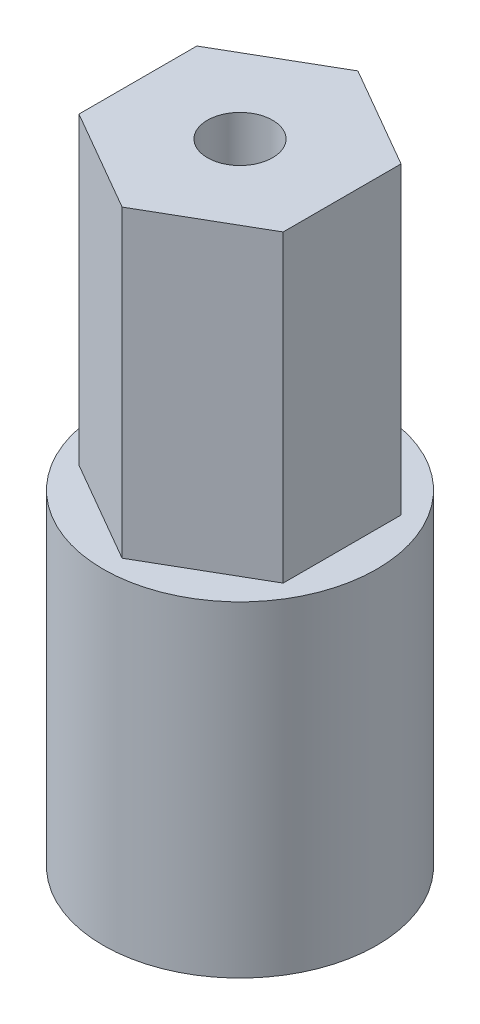
ISO-10303-21;
HEADER;
FILE_DESCRIPTION(('STEP AP214'),'2;1');
FILE_NAME('part.step','',(''),(''),'','','');
FILE_SCHEMA(('AUTOMOTIVE_DESIGN { 1 0 10303 214 1 1 1 1 }'));
ENDSEC;
DATA;
#1=APPLICATION_CONTEXT('core data for automotive mechanical design processes');
#2=APPLICATION_PROTOCOL_DEFINITION('international standard','automotive_design',2000,#1);
#3=PRODUCT_CONTEXT('',#1,'mechanical');
#4=PRODUCT('Part','Part','',(#3));
#5=PRODUCT_RELATED_PRODUCT_CATEGORY('part','',(#4));
#6=PRODUCT_DEFINITION_FORMATION('','',#4);
#7=PRODUCT_DEFINITION_CONTEXT('part definition',#1,'design');
#8=PRODUCT_DEFINITION('design','',#6,#7);
#9=PRODUCT_DEFINITION_SHAPE('','',#8);
#10=(LENGTH_UNIT() NAMED_UNIT(*) SI_UNIT(.MILLI.,.METRE.));
#11=(NAMED_UNIT(*) PLANE_ANGLE_UNIT() SI_UNIT($,.RADIAN.));
#12=(NAMED_UNIT(*) SI_UNIT($,.STERADIAN.) SOLID_ANGLE_UNIT());
#13=UNCERTAINTY_MEASURE_WITH_UNIT(LENGTH_MEASURE(1.E-05),#10,'distance_accuracy_value','');
#14=(GEOMETRIC_REPRESENTATION_CONTEXT(3) GLOBAL_UNCERTAINTY_ASSIGNED_CONTEXT((#13)) GLOBAL_UNIT_ASSIGNED_CONTEXT((#10,
#11,#12)) REPRESENTATION_CONTEXT('',''));
#15=CARTESIAN_POINT('',(0.,0.,0.));
#16=DIRECTION('',(0.,0.,1.));
#17=DIRECTION('',(1.,0.,0.));
#18=AXIS2_PLACEMENT_3D('',#15,#16,#17);
#19=CARTESIAN_POINT('',(0.,6.35,0.));
#20=DIRECTION('',(0.,-1.,0.));
#21=DIRECTION('',(0.,0.,-1.));
#22=AXIS2_PLACEMENT_3D('',#19,#20,#21);
#23=CYLINDRICAL_SURFACE('',#22,8.001);
#24=CARTESIAN_POINT('',(0.,6.35,0.));
#25=DIRECTION('',(0.,1.,0.));
#26=DIRECTION('',(0.,0.,1.));
#27=AXIS2_PLACEMENT_3D('',#24,#25,#26);
#28=CIRCLE('',#27,8.001);
#29=CARTESIAN_POINT('',(0.,6.35,8.001));
#30=VERTEX_POINT('',#29);
#31=EDGE_CURVE('E39',#30,#30,#28,.T.);
#32=ORIENTED_EDGE('',*,*,#31,.F.);
#33=EDGE_LOOP('',(#32));
#34=FACE_BOUND('',#33,.T.);
#35=CARTESIAN_POINT('',(0.,-12.7,0.));
#36=DIRECTION('',(0.,-1.,0.));
#37=DIRECTION('',(0.,0.,-1.));
#38=AXIS2_PLACEMENT_3D('',#35,#36,#37);
#39=CIRCLE('',#38,8.001);
#40=CARTESIAN_POINT('',(0.,-12.7,-8.001));
#41=VERTEX_POINT('',#40);
#42=EDGE_CURVE('E260',#41,#41,#39,.T.);
#43=ORIENTED_EDGE('',*,*,#42,.F.);
#44=EDGE_LOOP('',(#43));
#45=FACE_BOUND('',#44,.T.);
#46=ADVANCED_FACE('F32',(#34,#45),#23,.T.);
#47=CARTESIAN_POINT('',(0.,6.35,0.));
#48=DIRECTION('',(0.,1.,0.));
#49=DIRECTION('',(0.,0.,1.));
#50=AXIS2_PLACEMENT_3D('',#47,#48,#49);
#51=PLANE('',#50);
#52=DIRECTION('',(-0.866025403784439,0.,0.5));
#53=VECTOR('',#52,1.);
#54=CARTESIAN_POINT('',(0.,6.35,-6.89240751358575));
#55=LINE('',#54,#53);
#56=CARTESIAN_POINT('',(0.,6.35,-6.89240751358575));
#57=VERTEX_POINT('',#56);
#58=CARTESIAN_POINT('',(-5.969,6.35,-3.44620375679287));
#59=VERTEX_POINT('',#58);
#60=EDGE_CURVE('E387',#57,#59,#55,.T.);
#61=ORIENTED_EDGE('',*,*,#60,.F.);
#62=DIRECTION('',(-0.866025403784439,0.,-0.5));
#63=VECTOR('',#62,1.);
#64=CARTESIAN_POINT('',(5.969,6.35,-3.44620375679288));
#65=LINE('',#64,#63);
#66=CARTESIAN_POINT('',(5.969,6.35,-3.44620375679288));
#67=VERTEX_POINT('',#66);
#68=EDGE_CURVE('E180',#67,#57,#65,.T.);
#69=ORIENTED_EDGE('',*,*,#68,.F.);
#70=DIRECTION('',(0.,0.,-1.));
#71=VECTOR('',#70,1.);
#72=CARTESIAN_POINT('',(5.969,6.35,3.44620375679288));
#73=LINE('',#72,#71);
#74=CARTESIAN_POINT('',(5.969,6.35,3.44620375679288));
#75=VERTEX_POINT('',#74);
#76=EDGE_CURVE('E176',#75,#67,#73,.T.);
#77=ORIENTED_EDGE('',*,*,#76,.F.);
#78=DIRECTION('',(0.866025403784439,0.,-0.5));
#79=VECTOR('',#78,1.);
#80=CARTESIAN_POINT('',(0.,6.35,6.89240751358575));
#81=LINE('',#80,#79);
#82=CARTESIAN_POINT('',(0.,6.35,6.89240751358575));
#83=VERTEX_POINT('',#82);
#84=EDGE_CURVE('E402',#83,#75,#81,.T.);
#85=ORIENTED_EDGE('',*,*,#84,.F.);
#86=DIRECTION('',(0.866025403784439,0.,0.5));
#87=VECTOR('',#86,1.);
#88=CARTESIAN_POINT('',(-5.969,6.35,3.44620375679288));
#89=LINE('',#88,#87);
#90=CARTESIAN_POINT('',(-5.969,6.35,3.44620375679288));
#91=VERTEX_POINT('',#90);
#92=EDGE_CURVE('E400',#91,#83,#89,.T.);
#93=ORIENTED_EDGE('',*,*,#92,.F.);
#94=DIRECTION('',(0.,0.,1.));
#95=VECTOR('',#94,1.);
#96=CARTESIAN_POINT('',(-5.969,6.35,-3.44620375679287));
#97=LINE('',#96,#95);
#98=EDGE_CURVE('E398',#59,#91,#97,.T.);
#99=ORIENTED_EDGE('',*,*,#98,.F.);
#100=EDGE_LOOP('',(#61,#69,#77,#85,#93,#99));
#101=FACE_BOUND('',#100,.T.);
#102=ORIENTED_EDGE('',*,*,#31,.T.);
#103=EDGE_LOOP('',(#102));
#104=FACE_BOUND('',#103,.T.);
#105=ADVANCED_FACE('F286',(#101,#104),#51,.T.);
#106=CARTESIAN_POINT('',(0.,-12.7,0.));
#107=DIRECTION('',(0.,-1.,0.));
#108=DIRECTION('',(0.,0.,-1.));
#109=AXIS2_PLACEMENT_3D('',#106,#107,#108);
#110=PLANE('',#109);
#111=DIRECTION('',(-0.707103218807611,0.,-0.707110343547537));
#112=VECTOR('',#111,1.);
#113=CARTESIAN_POINT('',(8.53868524793363E-07,-12.7,2.79399090060982));
#114=LINE('',#113,#112);
#115=CARTESIAN_POINT('',(1.97564724721699,-12.7,4.76965720048164));
#116=VERTEX_POINT('',#115);
#117=CARTESIAN_POINT('',(8.53868524497425E-07,-12.7,2.79399090060982));
#118=VERTEX_POINT('',#117);
#119=EDGE_CURVE('E54',#116,#118,#114,.T.);
#120=ORIENTED_EDGE('',*,*,#119,.F.);
#121=DIRECTION('',(-0.707107824580712,0.,0.707105737790844));
#122=VECTOR('',#121,1.);
#123=CARTESIAN_POINT('',(1.97564724721699,-12.7,4.76965720048164));
#124=LINE('',#123,#122);
#125=CARTESIAN_POINT('',(4.7696513699937,-12.7,1.97566132326422));
#126=VERTEX_POINT('',#125);
#127=EDGE_CURVE('E193',#126,#116,#124,.T.);
#128=ORIENTED_EDGE('',*,*,#127,.F.);
#129=DIRECTION('',(0.707104999997735,0.,0.707108562370873));
#130=VECTOR('',#129,1.);
#131=CARTESIAN_POINT('',(2.79400000000003,-12.7,0.));
#132=LINE('',#131,#130);
#133=CARTESIAN_POINT('',(2.79400000000003,-12.7,0.));
#134=VERTEX_POINT('',#133);
#135=EDGE_CURVE('E253',#134,#126,#132,.T.);
#136=ORIENTED_EDGE('',*,*,#135,.F.);
#137=DIRECTION('',(-0.707106781186547,0.,0.707106781186548));
#138=VECTOR('',#137,1.);
#139=CARTESIAN_POINT('',(2.79400000000003,-12.7,0.));
#140=LINE('',#139,#138);
#141=CARTESIAN_POINT('',(4.76965634663521,-12.7,-1.97565634663518));
#142=VERTEX_POINT('',#141);
#143=EDGE_CURVE('E250',#142,#134,#140,.T.);
#144=ORIENTED_EDGE('',*,*,#143,.F.);
#145=DIRECTION('',(0.707106781186547,0.,0.707106781186548));
#146=VECTOR('',#145,1.);
#147=CARTESIAN_POINT('',(1.97565634663521,-12.7,-4.76965634663518));
#148=LINE('',#147,#146);
#149=CARTESIAN_POINT('',(1.97565634663521,-12.7,-4.76965634663518));
#150=VERTEX_POINT('',#149);
#151=EDGE_CURVE('E247',#150,#142,#148,.T.);
#152=ORIENTED_EDGE('',*,*,#151,.F.);
#153=DIRECTION('',(0.707106781186547,0.,-0.707106781186548));
#154=VECTOR('',#153,1.);
#155=CARTESIAN_POINT('',(0.,-12.7,-2.794));
#156=LINE('',#155,#154);
#157=CARTESIAN_POINT('',(0.,-12.7,-2.794));
#158=VERTEX_POINT('',#157);
#159=EDGE_CURVE('E244',#158,#150,#156,.T.);
#160=ORIENTED_EDGE('',*,*,#159,.F.);
#161=DIRECTION('',(0.707104999997736,0.,0.707108562370872));
#162=VECTOR('',#161,1.);
#163=CARTESIAN_POINT('',(0.,-12.7,-2.794));
#164=LINE('',#163,#162);
#165=CARTESIAN_POINT('',(-1.97565136999364,-12.7,-4.76966132326421));
#166=VERTEX_POINT('',#165);
#167=EDGE_CURVE('E241',#166,#158,#164,.T.);
#168=ORIENTED_EDGE('',*,*,#167,.F.);
#169=DIRECTION('',(0.707107824582027,0.,-0.707105737789529));
#170=VECTOR('',#169,1.);
#171=CARTESIAN_POINT('',(-4.76965549277547,-12.7,-1.97566544605207));
#172=LINE('',#171,#170);
#173=CARTESIAN_POINT('',(-4.76965549277547,-12.7,-1.97566544605207));
#174=VERTEX_POINT('',#173);
#175=EDGE_CURVE('E238',#174,#166,#172,.T.);
#176=ORIENTED_EDGE('',*,*,#175,.F.);
#177=DIRECTION('',(-0.707106475581773,0.,-0.70710708679119));
#178=VECTOR('',#177,1.);
#179=CARTESIAN_POINT('',(-2.794,-12.7,-8.24555748465006E-06));
#180=LINE('',#179,#178);
#181=CARTESIAN_POINT('',(-2.794,-12.7,-8.24555748465006E-06));
#182=VERTEX_POINT('',#181);
#183=EDGE_CURVE('E235',#182,#174,#180,.T.);
#184=ORIENTED_EDGE('',*,*,#183,.F.);
#185=DIRECTION('',(0.707106412290635,0.,-0.707107150082268));
#186=VECTOR('',#185,1.);
#187=CARTESIAN_POINT('',(-2.794,-12.7,-8.24555748465006E-06));
#188=LINE('',#187,#186);
#189=CARTESIAN_POINT('',(-4.76965531594011,-12.7,1.97564913177245));
#190=VERTEX_POINT('',#189);
#191=EDGE_CURVE('E232',#190,#182,#188,.T.);
#192=ORIENTED_EDGE('',*,*,#191,.F.);
#193=DIRECTION('',(-0.707106997279433,0.,-0.707106565093596));
#194=VECTOR('',#193,1.);
#195=CARTESIAN_POINT('',(-4.76965531594011,-12.7,1.97564913177245));
#196=LINE('',#195,#194);
#197=CARTESIAN_POINT('',(-1.97565446208955,-12.7,4.76964827792163));
#198=VERTEX_POINT('',#197);
#199=EDGE_CURVE('E229',#198,#190,#196,.T.);
#200=ORIENTED_EDGE('',*,*,#199,.F.);
#201=DIRECTION('',(-0.707106412297094,0.,0.707107150075809));
#202=VECTOR('',#201,1.);
#203=CARTESIAN_POINT('',(8.53868524793363E-07,-12.7,2.79399090060982));
#204=LINE('',#203,#202);
#205=EDGE_CURVE('E183',#118,#198,#204,.T.);
#206=ORIENTED_EDGE('',*,*,#205,.F.);
#207=EDGE_LOOP('',(#120,#128,#136,#144,#152,#160,#168,#176,#184,#192,#200,#206));
#208=FACE_BOUND('',#207,.T.);
#209=ORIENTED_EDGE('',*,*,#42,.T.);
#210=EDGE_LOOP('',(#209));
#211=FACE_BOUND('',#210,.T.);
#212=ADVANCED_FACE('F292',(#208,#211),#110,.T.);
#213=CARTESIAN_POINT('',(8.53868524793363E-07,0.,2.79399090060982));
#214=DIRECTION('',(-0.707110343547537,0.,0.707103218807611));
#215=DIRECTION('',(0.707103218807611,0.,0.707110343547537));
#216=AXIS2_PLACEMENT_3D('',#213,#214,#215);
#217=PLANE('',#216);
#218=ORIENTED_EDGE('',*,*,#119,.T.);
#219=DIRECTION('',(0.,-1.,0.));
#220=VECTOR('',#219,1.);
#221=CARTESIAN_POINT('',(8.53868524793363E-07,0.,2.79399090060982));
#222=LINE('',#221,#220);
#223=CARTESIAN_POINT('',(8.53868524793363E-07,0.,2.79399090060982));
#224=VERTEX_POINT('',#223);
#225=EDGE_CURVE('E225',#224,#118,#222,.T.);
#226=ORIENTED_EDGE('',*,*,#225,.F.);
#227=DIRECTION('',(-0.707103218807611,0.,-0.707110343547537));
#228=VECTOR('',#227,1.);
#229=CARTESIAN_POINT('',(8.53868524793363E-07,0.,2.79399090060982));
#230=LINE('',#229,#228);
#231=CARTESIAN_POINT('',(1.97564724721699,0.,4.76965720048164));
#232=VERTEX_POINT('',#231);
#233=EDGE_CURVE('E189',#232,#224,#230,.T.);
#234=ORIENTED_EDGE('',*,*,#233,.F.);
#235=DIRECTION('',(0.,-1.,0.));
#236=VECTOR('',#235,1.);
#237=CARTESIAN_POINT('',(1.97564724721699,0.,4.76965720048164));
#238=LINE('',#237,#236);
#239=EDGE_CURVE('E258',#232,#116,#238,.T.);
#240=ORIENTED_EDGE('',*,*,#239,.T.);
#241=EDGE_LOOP('',(#218,#226,#234,#240));
#242=FACE_BOUND('',#241,.T.);
#243=ADVANCED_FACE('F294',(#242),#217,.F.);
#244=CARTESIAN_POINT('',(1.97564724721699,0.,4.76965720048164));
#245=DIRECTION('',(0.707105737790844,0.,0.707107824580712));
#246=DIRECTION('',(0.707107824580712,0.,-0.707105737790844));
#247=AXIS2_PLACEMENT_3D('',#244,#245,#246);
#248=PLANE('',#247);
#249=ORIENTED_EDGE('',*,*,#127,.T.);
#250=ORIENTED_EDGE('',*,*,#239,.F.);
#251=DIRECTION('',(-0.707107824580712,0.,0.707105737790844));
#252=VECTOR('',#251,1.);
#253=CARTESIAN_POINT('',(1.97564724721699,0.,4.76965720048164));
#254=LINE('',#253,#252);
#255=CARTESIAN_POINT('',(4.7696513699937,0.,1.97566132326422));
#256=VERTEX_POINT('',#255);
#257=EDGE_CURVE('E223',#256,#232,#254,.T.);
#258=ORIENTED_EDGE('',*,*,#257,.F.);
#259=DIRECTION('',(0.,-1.,0.));
#260=VECTOR('',#259,1.);
#261=CARTESIAN_POINT('',(4.7696513699937,0.,1.97566132326422));
#262=LINE('',#261,#260);
#263=EDGE_CURVE('E261',#256,#126,#262,.T.);
#264=ORIENTED_EDGE('',*,*,#263,.T.);
#265=EDGE_LOOP('',(#249,#250,#258,#264));
#266=FACE_BOUND('',#265,.T.);
#267=ADVANCED_FACE('F301',(#266),#248,.F.);
#268=CARTESIAN_POINT('',(2.79400000000003,0.,0.));
#269=DIRECTION('',(0.707108562370873,0.,-0.707104999997735));
#270=DIRECTION('',(-0.707104999997735,0.,-0.707108562370873));
#271=AXIS2_PLACEMENT_3D('',#268,#269,#270);
#272=PLANE('',#271);
#273=ORIENTED_EDGE('',*,*,#135,.T.);
#274=ORIENTED_EDGE('',*,*,#263,.F.);
#275=DIRECTION('',(0.707104999997735,0.,0.707108562370873));
#276=VECTOR('',#275,1.);
#277=CARTESIAN_POINT('',(2.79400000000003,0.,0.));
#278=LINE('',#277,#276);
#279=CARTESIAN_POINT('',(2.79400000000003,0.,0.));
#280=VERTEX_POINT('',#279);
#281=EDGE_CURVE('E220',#280,#256,#278,.T.);
#282=ORIENTED_EDGE('',*,*,#281,.F.);
#283=DIRECTION('',(0.,-1.,0.));
#284=VECTOR('',#283,1.);
#285=CARTESIAN_POINT('',(2.79400000000003,0.,0.));
#286=LINE('',#285,#284);
#287=EDGE_CURVE('E263',#280,#134,#286,.T.);
#288=ORIENTED_EDGE('',*,*,#287,.T.);
#289=EDGE_LOOP('',(#273,#274,#282,#288));
#290=FACE_BOUND('',#289,.T.);
#291=ADVANCED_FACE('F342',(#290),#272,.F.);
#292=CARTESIAN_POINT('',(2.79400000000003,0.,0.));
#293=DIRECTION('',(0.707106781186548,0.,0.707106781186547));
#294=DIRECTION('',(0.707106781186547,0.,-0.707106781186548));
#295=AXIS2_PLACEMENT_3D('',#292,#293,#294);
#296=PLANE('',#295);
#297=ORIENTED_EDGE('',*,*,#143,.T.);
#298=ORIENTED_EDGE('',*,*,#287,.F.);
#299=DIRECTION('',(-0.707106781186547,0.,0.707106781186548));
#300=VECTOR('',#299,1.);
#301=CARTESIAN_POINT('',(2.79400000000003,0.,0.));
#302=LINE('',#301,#300);
#303=CARTESIAN_POINT('',(4.76965634663521,0.,-1.97565634663518));
#304=VERTEX_POINT('',#303);
#305=EDGE_CURVE('E217',#304,#280,#302,.T.);
#306=ORIENTED_EDGE('',*,*,#305,.F.);
#307=DIRECTION('',(0.,-1.,0.));
#308=VECTOR('',#307,1.);
#309=CARTESIAN_POINT('',(4.76965634663521,0.,-1.97565634663518));
#310=LINE('',#309,#308);
#311=EDGE_CURVE('E265',#304,#142,#310,.T.);
#312=ORIENTED_EDGE('',*,*,#311,.T.);
#313=EDGE_LOOP('',(#297,#298,#306,#312));
#314=FACE_BOUND('',#313,.T.);
#315=ADVANCED_FACE('F338',(#314),#296,.F.);
#316=CARTESIAN_POINT('',(1.97565634663521,0.,-4.76965634663518));
#317=DIRECTION('',(0.707106781186548,0.,-0.707106781186547));
#318=DIRECTION('',(-0.707106781186547,0.,-0.707106781186548));
#319=AXIS2_PLACEMENT_3D('',#316,#317,#318);
#320=PLANE('',#319);
#321=ORIENTED_EDGE('',*,*,#151,.T.);
#322=ORIENTED_EDGE('',*,*,#311,.F.);
#323=DIRECTION('',(0.707106781186547,0.,0.707106781186548));
#324=VECTOR('',#323,1.);
#325=CARTESIAN_POINT('',(1.97565634663521,0.,-4.76965634663518));
#326=LINE('',#325,#324);
#327=CARTESIAN_POINT('',(1.97565634663521,0.,-4.76965634663518));
#328=VERTEX_POINT('',#327);
#329=EDGE_CURVE('E214',#328,#304,#326,.T.);
#330=ORIENTED_EDGE('',*,*,#329,.F.);
#331=DIRECTION('',(0.,-1.,0.));
#332=VECTOR('',#331,1.);
#333=CARTESIAN_POINT('',(1.97565634663521,0.,-4.76965634663518));
#334=LINE('',#333,#332);
#335=EDGE_CURVE('E267',#328,#150,#334,.T.);
#336=ORIENTED_EDGE('',*,*,#335,.T.);
#337=EDGE_LOOP('',(#321,#322,#330,#336));
#338=FACE_BOUND('',#337,.T.);
#339=ADVANCED_FACE('F334',(#338),#320,.F.);
#340=CARTESIAN_POINT('',(0.,0.,-2.794));
#341=DIRECTION('',(-0.707106781186548,0.,-0.707106781186547));
#342=DIRECTION('',(-0.707106781186547,0.,0.707106781186548));
#343=AXIS2_PLACEMENT_3D('',#340,#341,#342);
#344=PLANE('',#343);
#345=ORIENTED_EDGE('',*,*,#159,.T.);
#346=ORIENTED_EDGE('',*,*,#335,.F.);
#347=DIRECTION('',(0.707106781186547,0.,-0.707106781186548));
#348=VECTOR('',#347,1.);
#349=CARTESIAN_POINT('',(0.,0.,-2.794));
#350=LINE('',#349,#348);
#351=CARTESIAN_POINT('',(0.,0.,-2.794));
#352=VERTEX_POINT('',#351);
#353=EDGE_CURVE('E211',#352,#328,#350,.T.);
#354=ORIENTED_EDGE('',*,*,#353,.F.);
#355=DIRECTION('',(0.,-1.,0.));
#356=VECTOR('',#355,1.);
#357=CARTESIAN_POINT('',(0.,0.,-2.794));
#358=LINE('',#357,#356);
#359=EDGE_CURVE('E269',#352,#158,#358,.T.);
#360=ORIENTED_EDGE('',*,*,#359,.T.);
#361=EDGE_LOOP('',(#345,#346,#354,#360));
#362=FACE_BOUND('',#361,.T.);
#363=ADVANCED_FACE('F330',(#362),#344,.F.);
#364=CARTESIAN_POINT('',(0.,0.,-2.794));
#365=DIRECTION('',(0.707108562370872,0.,-0.707104999997736));
#366=DIRECTION('',(-0.707104999997736,0.,-0.707108562370872));
#367=AXIS2_PLACEMENT_3D('',#364,#365,#366);
#368=PLANE('',#367);
#369=ORIENTED_EDGE('',*,*,#167,.T.);
#370=ORIENTED_EDGE('',*,*,#359,.F.);
#371=DIRECTION('',(0.707104999997736,0.,0.707108562370872));
#372=VECTOR('',#371,1.);
#373=CARTESIAN_POINT('',(0.,0.,-2.794));
#374=LINE('',#373,#372);
#375=CARTESIAN_POINT('',(-1.97565136999364,0.,-4.76966132326421));
#376=VERTEX_POINT('',#375);
#377=EDGE_CURVE('E208',#376,#352,#374,.T.);
#378=ORIENTED_EDGE('',*,*,#377,.F.);
#379=DIRECTION('',(0.,-1.,0.));
#380=VECTOR('',#379,1.);
#381=CARTESIAN_POINT('',(-1.97565136999364,0.,-4.76966132326421));
#382=LINE('',#381,#380);
#383=EDGE_CURVE('E271',#376,#166,#382,.T.);
#384=ORIENTED_EDGE('',*,*,#383,.T.);
#385=EDGE_LOOP('',(#369,#370,#378,#384));
#386=FACE_BOUND('',#385,.T.);
#387=ADVANCED_FACE('F326',(#386),#368,.F.);
#388=CARTESIAN_POINT('',(-4.76965549277547,0.,-1.97566544605207));
#389=DIRECTION('',(-0.707105737789529,0.,-0.707107824582026));
#390=DIRECTION('',(-0.707107824582026,0.,0.707105737789529));
#391=AXIS2_PLACEMENT_3D('',#388,#389,#390);
#392=PLANE('',#391);
#393=ORIENTED_EDGE('',*,*,#175,.T.);
#394=ORIENTED_EDGE('',*,*,#383,.F.);
#395=DIRECTION('',(0.707107824582027,0.,-0.707105737789529));
#396=VECTOR('',#395,1.);
#397=CARTESIAN_POINT('',(-4.76965549277547,0.,-1.97566544605207));
#398=LINE('',#397,#396);
#399=CARTESIAN_POINT('',(-4.76965549277547,0.,-1.97566544605207));
#400=VERTEX_POINT('',#399);
#401=EDGE_CURVE('E205',#400,#376,#398,.T.);
#402=ORIENTED_EDGE('',*,*,#401,.F.);
#403=DIRECTION('',(0.,-1.,0.));
#404=VECTOR('',#403,1.);
#405=CARTESIAN_POINT('',(-4.76965549277547,0.,-1.97566544605207));
#406=LINE('',#405,#404);
#407=EDGE_CURVE('E273',#400,#174,#406,.T.);
#408=ORIENTED_EDGE('',*,*,#407,.T.);
#409=EDGE_LOOP('',(#393,#394,#402,#408));
#410=FACE_BOUND('',#409,.T.);
#411=ADVANCED_FACE('F322',(#410),#392,.F.);
#412=CARTESIAN_POINT('',(-2.794,0.,-8.24555748465006E-06));
#413=DIRECTION('',(-0.70710708679119,0.,0.707106475581773));
#414=DIRECTION('',(0.707106475581773,0.,0.70710708679119));
#415=AXIS2_PLACEMENT_3D('',#412,#413,#414);
#416=PLANE('',#415);
#417=ORIENTED_EDGE('',*,*,#183,.T.);
#418=ORIENTED_EDGE('',*,*,#407,.F.);
#419=DIRECTION('',(-0.707106475581773,0.,-0.70710708679119));
#420=VECTOR('',#419,1.);
#421=CARTESIAN_POINT('',(-2.794,0.,-8.24555748465006E-06));
#422=LINE('',#421,#420);
#423=CARTESIAN_POINT('',(-2.794,0.,-8.24555748465006E-06));
#424=VERTEX_POINT('',#423);
#425=EDGE_CURVE('E202',#424,#400,#422,.T.);
#426=ORIENTED_EDGE('',*,*,#425,.F.);
#427=DIRECTION('',(0.,-1.,0.));
#428=VECTOR('',#427,1.);
#429=CARTESIAN_POINT('',(-2.794,0.,-8.24555748465006E-06));
#430=LINE('',#429,#428);
#431=EDGE_CURVE('E275',#424,#182,#430,.T.);
#432=ORIENTED_EDGE('',*,*,#431,.T.);
#433=EDGE_LOOP('',(#417,#418,#426,#432));
#434=FACE_BOUND('',#433,.T.);
#435=ADVANCED_FACE('F318',(#434),#416,.F.);
#436=CARTESIAN_POINT('',(-2.794,0.,-8.24555748465006E-06));
#437=DIRECTION('',(-0.707107150082268,0.,-0.707106412290635));
#438=DIRECTION('',(-0.707106412290635,0.,0.707107150082268));
#439=AXIS2_PLACEMENT_3D('',#436,#437,#438);
#440=PLANE('',#439);
#441=ORIENTED_EDGE('',*,*,#191,.T.);
#442=ORIENTED_EDGE('',*,*,#431,.F.);
#443=DIRECTION('',(0.707106412290635,0.,-0.707107150082268));
#444=VECTOR('',#443,1.);
#445=CARTESIAN_POINT('',(-2.794,0.,-8.24555748465006E-06));
#446=LINE('',#445,#444);
#447=CARTESIAN_POINT('',(-4.76965531594011,0.,1.97564913177245));
#448=VERTEX_POINT('',#447);
#449=EDGE_CURVE('E199',#448,#424,#446,.T.);
#450=ORIENTED_EDGE('',*,*,#449,.F.);
#451=DIRECTION('',(0.,-1.,0.));
#452=VECTOR('',#451,1.);
#453=CARTESIAN_POINT('',(-4.76965531594011,0.,1.97564913177245));
#454=LINE('',#453,#452);
#455=EDGE_CURVE('E277',#448,#190,#454,.T.);
#456=ORIENTED_EDGE('',*,*,#455,.T.);
#457=EDGE_LOOP('',(#441,#442,#450,#456));
#458=FACE_BOUND('',#457,.T.);
#459=ADVANCED_FACE('F314',(#458),#440,.F.);
#460=CARTESIAN_POINT('',(-4.76965531594011,0.,1.97564913177245));
#461=DIRECTION('',(-0.707106565093596,0.,0.707106997279433));
#462=DIRECTION('',(0.707106997279433,0.,0.707106565093596));
#463=AXIS2_PLACEMENT_3D('',#460,#461,#462);
#464=PLANE('',#463);
#465=ORIENTED_EDGE('',*,*,#199,.T.);
#466=ORIENTED_EDGE('',*,*,#455,.F.);
#467=DIRECTION('',(-0.707106997279433,0.,-0.707106565093596));
#468=VECTOR('',#467,1.);
#469=CARTESIAN_POINT('',(-4.76965531594011,0.,1.97564913177245));
#470=LINE('',#469,#468);
#471=CARTESIAN_POINT('',(-1.97565446208955,0.,4.76964827792163));
#472=VERTEX_POINT('',#471);
#473=EDGE_CURVE('E196',#472,#448,#470,.T.);
#474=ORIENTED_EDGE('',*,*,#473,.F.);
#475=DIRECTION('',(0.,-1.,0.));
#476=VECTOR('',#475,1.);
#477=CARTESIAN_POINT('',(-1.97565446208955,0.,4.76964827792163));
#478=LINE('',#477,#476);
#479=EDGE_CURVE('E279',#472,#198,#478,.T.);
#480=ORIENTED_EDGE('',*,*,#479,.T.);
#481=EDGE_LOOP('',(#465,#466,#474,#480));
#482=FACE_BOUND('',#481,.T.);
#483=ADVANCED_FACE('F310',(#482),#464,.F.);
#484=CARTESIAN_POINT('',(8.53868524793363E-07,0.,2.79399090060982));
#485=DIRECTION('',(0.707107150075809,0.,0.707106412297094));
#486=DIRECTION('',(0.707106412297094,0.,-0.707107150075809));
#487=AXIS2_PLACEMENT_3D('',#484,#485,#486);
#488=PLANE('',#487);
#489=ORIENTED_EDGE('',*,*,#205,.T.);
#490=ORIENTED_EDGE('',*,*,#479,.F.);
#491=DIRECTION('',(-0.707106412297094,0.,0.707107150075809));
#492=VECTOR('',#491,1.);
#493=CARTESIAN_POINT('',(8.53868524793363E-07,0.,2.79399090060982));
#494=LINE('',#493,#492);
#495=EDGE_CURVE('E192',#224,#472,#494,.T.);
#496=ORIENTED_EDGE('',*,*,#495,.F.);
#497=ORIENTED_EDGE('',*,*,#225,.T.);
#498=EDGE_LOOP('',(#489,#490,#496,#497));
#499=FACE_BOUND('',#498,.T.);
#500=ADVANCED_FACE('F306',(#499),#488,.F.);
#501=CARTESIAN_POINT('',(0.,0.,0.));
#502=DIRECTION('',(0.,1.,0.));
#503=DIRECTION('',(0.,0.,1.));
#504=AXIS2_PLACEMENT_3D('',#501,#502,#503);
#505=PLANE('',#504);
#506=ORIENTED_EDGE('',*,*,#233,.T.);
#507=ORIENTED_EDGE('',*,*,#495,.T.);
#508=ORIENTED_EDGE('',*,*,#473,.T.);
#509=ORIENTED_EDGE('',*,*,#449,.T.);
#510=ORIENTED_EDGE('',*,*,#425,.T.);
#511=ORIENTED_EDGE('',*,*,#401,.T.);
#512=ORIENTED_EDGE('',*,*,#377,.T.);
#513=ORIENTED_EDGE('',*,*,#353,.T.);
#514=ORIENTED_EDGE('',*,*,#329,.T.);
#515=ORIENTED_EDGE('',*,*,#305,.T.);
#516=ORIENTED_EDGE('',*,*,#281,.T.);
#517=ORIENTED_EDGE('',*,*,#257,.T.);
#518=EDGE_LOOP('',(#506,#507,#508,#509,#510,#511,#512,#513,#514,#515,#516,#517));
#519=FACE_BOUND('',#518,.T.);
#520=ADVANCED_FACE('F309',(#519),#505,.F.);
#521=CARTESIAN_POINT('',(0.,24.13,0.));
#522=DIRECTION('',(0.,1.,0.));
#523=DIRECTION('',(0.,0.,1.));
#524=AXIS2_PLACEMENT_3D('',#521,#522,#523);
#525=PLANE('',#524);
#526=DIRECTION('',(-0.866025403784439,0.,-0.5));
#527=VECTOR('',#526,1.);
#528=CARTESIAN_POINT('',(5.969,24.13,-3.44620375679288));
#529=LINE('',#528,#527);
#530=CARTESIAN_POINT('',(5.969,24.13,-3.44620375679288));
#531=VERTEX_POINT('',#530);
#532=CARTESIAN_POINT('',(0.,24.13,-6.89240751358575));
#533=VERTEX_POINT('',#532);
#534=EDGE_CURVE('E167',#531,#533,#529,.T.);
#535=ORIENTED_EDGE('',*,*,#534,.T.);
#536=DIRECTION('',(-0.866025403784439,0.,0.5));
#537=VECTOR('',#536,1.);
#538=CARTESIAN_POINT('',(0.,24.13,-6.89240751358575));
#539=LINE('',#538,#537);
#540=CARTESIAN_POINT('',(-5.969,24.13,-3.44620375679287));
#541=VERTEX_POINT('',#540);
#542=EDGE_CURVE('E156',#533,#541,#539,.T.);
#543=ORIENTED_EDGE('',*,*,#542,.T.);
#544=DIRECTION('',(0.,0.,1.));
#545=VECTOR('',#544,1.);
#546=CARTESIAN_POINT('',(-5.969,24.13,-3.44620375679287));
#547=LINE('',#546,#545);
#548=CARTESIAN_POINT('',(-5.969,24.13,3.44620375679288));
#549=VERTEX_POINT('',#548);
#550=EDGE_CURVE('E166',#541,#549,#547,.T.);
#551=ORIENTED_EDGE('',*,*,#550,.T.);
#552=DIRECTION('',(0.866025403784439,0.,0.5));
#553=VECTOR('',#552,1.);
#554=CARTESIAN_POINT('',(-5.969,24.13,3.44620375679288));
#555=LINE('',#554,#553);
#556=CARTESIAN_POINT('',(0.,24.13,6.89240751358575));
#557=VERTEX_POINT('',#556);
#558=EDGE_CURVE('E391',#549,#557,#555,.T.);
#559=ORIENTED_EDGE('',*,*,#558,.T.);
#560=DIRECTION('',(0.866025403784439,0.,-0.5));
#561=VECTOR('',#560,1.);
#562=CARTESIAN_POINT('',(0.,24.13,6.89240751358575));
#563=LINE('',#562,#561);
#564=CARTESIAN_POINT('',(5.969,24.13,3.44620375679288));
#565=VERTEX_POINT('',#564);
#566=EDGE_CURVE('E393',#557,#565,#563,.T.);
#567=ORIENTED_EDGE('',*,*,#566,.T.);
#568=DIRECTION('',(0.,0.,-1.));
#569=VECTOR('',#568,1.);
#570=CARTESIAN_POINT('',(5.969,24.13,3.44620375679288));
#571=LINE('',#570,#569);
#572=EDGE_CURVE('E172',#565,#531,#571,.T.);
#573=ORIENTED_EDGE('',*,*,#572,.T.);
#574=EDGE_LOOP('',(#535,#543,#551,#559,#567,#573));
#575=FACE_BOUND('',#574,.T.);
#576=CARTESIAN_POINT('',(0.,24.13,0.));
#577=DIRECTION('',(0.,1.,0.));
#578=DIRECTION('',(0.,0.,1.));
#579=AXIS2_PLACEMENT_3D('',#576,#577,#578);
#580=CIRCLE('',#579,1.905);
#581=CARTESIAN_POINT('',(0.,24.13,1.905));
#582=VERTEX_POINT('',#581);
#583=EDGE_CURVE('E384',#582,#582,#580,.T.);
#584=ORIENTED_EDGE('',*,*,#583,.F.);
#585=EDGE_LOOP('',(#584));
#586=FACE_BOUND('',#585,.T.);
#587=ADVANCED_FACE('F170',(#575,#586),#525,.T.);
#588=CARTESIAN_POINT('',(5.969,24.13,-3.44620375679288));
#589=DIRECTION('',(-0.5,0.,0.866025403784439));
#590=DIRECTION('',(0.866025403784439,0.,0.5));
#591=AXIS2_PLACEMENT_3D('',#588,#589,#590);
#592=PLANE('',#591);
#593=ORIENTED_EDGE('',*,*,#68,.T.);
#594=DIRECTION('',(0.,-1.,0.));
#595=VECTOR('',#594,1.);
#596=CARTESIAN_POINT('',(0.,24.13,-6.89240751358575));
#597=LINE('',#596,#595);
#598=EDGE_CURVE('E160',#533,#57,#597,.T.);
#599=ORIENTED_EDGE('',*,*,#598,.F.);
#600=ORIENTED_EDGE('',*,*,#534,.F.);
#601=DIRECTION('',(0.,-1.,0.));
#602=VECTOR('',#601,1.);
#603=CARTESIAN_POINT('',(5.969,24.13,-3.44620375679288));
#604=LINE('',#603,#602);
#605=EDGE_CURVE('E395',#531,#67,#604,.T.);
#606=ORIENTED_EDGE('',*,*,#605,.T.);
#607=EDGE_LOOP('',(#593,#599,#600,#606));
#608=FACE_BOUND('',#607,.T.);
#609=ADVANCED_FACE('F178',(#608),#592,.F.);
#610=CARTESIAN_POINT('',(0.,24.13,-6.89240751358575));
#611=DIRECTION('',(0.5,0.,0.866025403784439));
#612=DIRECTION('',(0.866025403784439,0.,-0.5));
#613=AXIS2_PLACEMENT_3D('',#610,#611,#612);
#614=PLANE('',#613);
#615=ORIENTED_EDGE('',*,*,#60,.T.);
#616=DIRECTION('',(0.,-1.,0.));
#617=VECTOR('',#616,1.);
#618=CARTESIAN_POINT('',(-5.969,24.13,-3.44620375679287));
#619=LINE('',#618,#617);
#620=EDGE_CURVE('E163',#541,#59,#619,.T.);
#621=ORIENTED_EDGE('',*,*,#620,.F.);
#622=ORIENTED_EDGE('',*,*,#542,.F.);
#623=ORIENTED_EDGE('',*,*,#598,.T.);
#624=EDGE_LOOP('',(#615,#621,#622,#623));
#625=FACE_BOUND('',#624,.T.);
#626=ADVANCED_FACE('F158',(#625),#614,.F.);
#627=CARTESIAN_POINT('',(-5.969,24.13,-3.44620375679287));
#628=DIRECTION('',(1.,0.,0.));
#629=DIRECTION('',(0.,0.,-1.));
#630=AXIS2_PLACEMENT_3D('',#627,#628,#629);
#631=PLANE('',#630);
#632=ORIENTED_EDGE('',*,*,#98,.T.);
#633=DIRECTION('',(0.,-1.,0.));
#634=VECTOR('',#633,1.);
#635=CARTESIAN_POINT('',(-5.969,24.13,3.44620375679288));
#636=LINE('',#635,#634);
#637=EDGE_CURVE('E185',#549,#91,#636,.T.);
#638=ORIENTED_EDGE('',*,*,#637,.F.);
#639=ORIENTED_EDGE('',*,*,#550,.F.);
#640=ORIENTED_EDGE('',*,*,#620,.T.);
#641=EDGE_LOOP('',(#632,#638,#639,#640));
#642=FACE_BOUND('',#641,.T.);
#643=ADVANCED_FACE('F357',(#642),#631,.F.);
#644=CARTESIAN_POINT('',(-5.969,24.13,3.44620375679288));
#645=DIRECTION('',(0.5,0.,-0.866025403784439));
#646=DIRECTION('',(-0.866025403784439,0.,-0.5));
#647=AXIS2_PLACEMENT_3D('',#644,#645,#646);
#648=PLANE('',#647);
#649=ORIENTED_EDGE('',*,*,#92,.T.);
#650=DIRECTION('',(0.,-1.,0.));
#651=VECTOR('',#650,1.);
#652=CARTESIAN_POINT('',(0.,24.13,6.89240751358575));
#653=LINE('',#652,#651);
#654=EDGE_CURVE('E407',#557,#83,#653,.T.);
#655=ORIENTED_EDGE('',*,*,#654,.F.);
#656=ORIENTED_EDGE('',*,*,#558,.F.);
#657=ORIENTED_EDGE('',*,*,#637,.T.);
#658=EDGE_LOOP('',(#649,#655,#656,#657));
#659=FACE_BOUND('',#658,.T.);
#660=ADVANCED_FACE('F360',(#659),#648,.F.);
#661=CARTESIAN_POINT('',(0.,24.13,6.89240751358575));
#662=DIRECTION('',(-0.5,0.,-0.866025403784439));
#663=DIRECTION('',(-0.866025403784439,0.,0.5));
#664=AXIS2_PLACEMENT_3D('',#661,#662,#663);
#665=PLANE('',#664);
#666=ORIENTED_EDGE('',*,*,#84,.T.);
#667=DIRECTION('',(0.,-1.,0.));
#668=VECTOR('',#667,1.);
#669=CARTESIAN_POINT('',(5.969,24.13,3.44620375679288));
#670=LINE('',#669,#668);
#671=EDGE_CURVE('E46',#565,#75,#670,.T.);
#672=ORIENTED_EDGE('',*,*,#671,.F.);
#673=ORIENTED_EDGE('',*,*,#566,.F.);
#674=ORIENTED_EDGE('',*,*,#654,.T.);
#675=EDGE_LOOP('',(#666,#672,#673,#674));
#676=FACE_BOUND('',#675,.T.);
#677=ADVANCED_FACE('F364',(#676),#665,.F.);
#678=CARTESIAN_POINT('',(5.969,24.13,3.44620375679288));
#679=DIRECTION('',(-1.,0.,0.));
#680=DIRECTION('',(0.,0.,1.));
#681=AXIS2_PLACEMENT_3D('',#678,#679,#680);
#682=PLANE('',#681);
#683=ORIENTED_EDGE('',*,*,#76,.T.);
#684=ORIENTED_EDGE('',*,*,#605,.F.);
#685=ORIENTED_EDGE('',*,*,#572,.F.);
#686=ORIENTED_EDGE('',*,*,#671,.T.);
#687=EDGE_LOOP('',(#683,#684,#685,#686));
#688=FACE_BOUND('',#687,.T.);
#689=ADVANCED_FACE('F368',(#688),#682,.F.);
#690=CARTESIAN_POINT('',(0.,24.13,0.));
#691=DIRECTION('',(0.,-1.,0.));
#692=DIRECTION('',(0.,0.,-1.));
#693=AXIS2_PLACEMENT_3D('',#690,#691,#692);
#694=CYLINDRICAL_SURFACE('',#693,1.905);
#695=ORIENTED_EDGE('',*,*,#583,.T.);
#696=EDGE_LOOP('',(#695));
#697=FACE_BOUND('',#696,.T.);
#698=CARTESIAN_POINT('',(0.,6.35,0.));
#699=DIRECTION('',(0.,1.,0.));
#700=DIRECTION('',(0.,0.,1.));
#701=AXIS2_PLACEMENT_3D('',#698,#699,#700);
#702=CIRCLE('',#701,1.905);
#703=CARTESIAN_POINT('',(0.,6.35,1.905));
#704=VERTEX_POINT('',#703);
#705=EDGE_CURVE('E11',#704,#704,#702,.F.);
#706=ORIENTED_EDGE('',*,*,#705,.T.);
#707=EDGE_LOOP('',(#706));
#708=FACE_BOUND('',#707,.T.);
#709=ADVANCED_FACE('F372',(#697,#708),#694,.F.);
#710=ORIENTED_EDGE('',*,*,#705,.F.);
#711=EDGE_LOOP('',(#710));
#712=FACE_BOUND('',#711,.T.);
#713=ADVANCED_FACE('F304',(#712),#51,.T.);
#714=CLOSED_SHELL('',(#46,#105,#212,#243,#267,#291,#315,#339,#363,#387,#411,#435,#459,#483,#500,
#520,#587,#609,#626,#643,#660,#677,#689,#709,#713));
#715=MANIFOLD_SOLID_BREP('B2',#714);
#716=ADVANCED_BREP_SHAPE_REPRESENTATION('',(#18,#715),#14);
#717=SHAPE_DEFINITION_REPRESENTATION(#9,#716);
ENDSEC;
END-ISO-10303-21;
